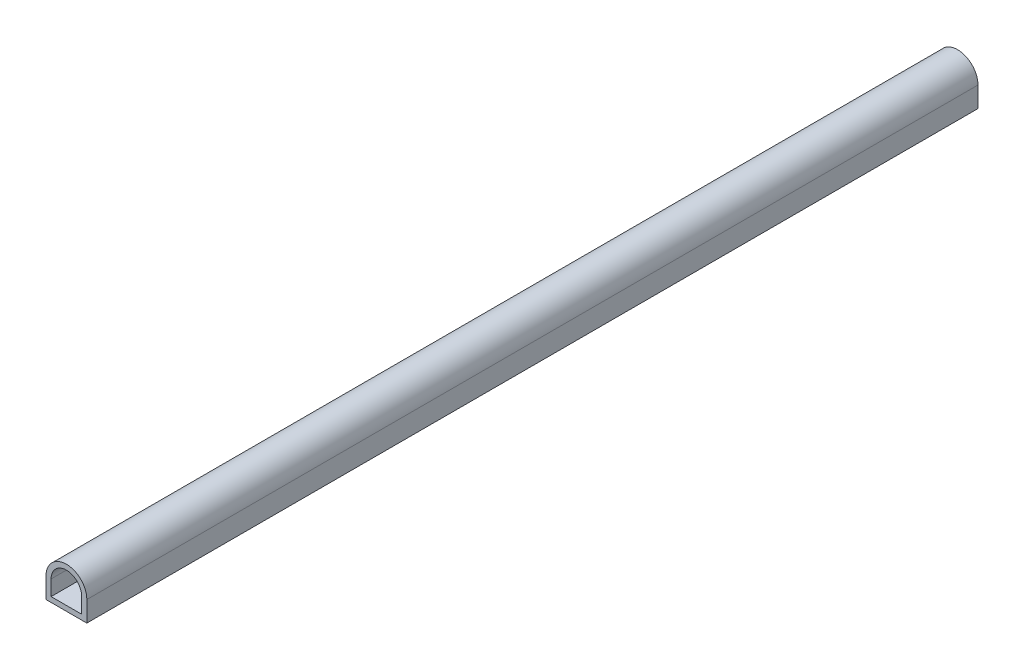
ISO-10303-21;
HEADER;
FILE_DESCRIPTION(('STEP AP214'),'2;1');
FILE_NAME('part.step','',(''),(''),'','','');
FILE_SCHEMA(('AUTOMOTIVE_DESIGN { 1 0 10303 214 1 1 1 1 }'));
ENDSEC;
DATA;
#1=APPLICATION_CONTEXT('core data for automotive mechanical design processes');
#2=APPLICATION_PROTOCOL_DEFINITION('international standard','automotive_design',2000,#1);
#3=PRODUCT_CONTEXT('',#1,'mechanical');
#4=PRODUCT('Part','Part','',(#3));
#5=PRODUCT_RELATED_PRODUCT_CATEGORY('part','',(#4));
#6=PRODUCT_DEFINITION_FORMATION('','',#4);
#7=PRODUCT_DEFINITION_CONTEXT('part definition',#1,'design');
#8=PRODUCT_DEFINITION('design','',#6,#7);
#9=PRODUCT_DEFINITION_SHAPE('','',#8);
#10=(LENGTH_UNIT() NAMED_UNIT(*) SI_UNIT(.MILLI.,.METRE.));
#11=(NAMED_UNIT(*) PLANE_ANGLE_UNIT() SI_UNIT($,.RADIAN.));
#12=(NAMED_UNIT(*) SI_UNIT($,.STERADIAN.) SOLID_ANGLE_UNIT());
#13=UNCERTAINTY_MEASURE_WITH_UNIT(LENGTH_MEASURE(1.E-05),#10,'distance_accuracy_value','');
#14=(GEOMETRIC_REPRESENTATION_CONTEXT(3) GLOBAL_UNCERTAINTY_ASSIGNED_CONTEXT((#13)) GLOBAL_UNIT_ASSIGNED_CONTEXT((#10,
#11,#12)) REPRESENTATION_CONTEXT('',''));
#15=CARTESIAN_POINT('',(0.,0.,0.));
#16=DIRECTION('',(0.,0.,1.));
#17=DIRECTION('',(1.,0.,0.));
#18=AXIS2_PLACEMENT_3D('',#15,#16,#17);
#19=CARTESIAN_POINT('',(0.,0.,131.));
#20=DIRECTION('',(0.,0.,1.));
#21=DIRECTION('',(1.,0.,0.));
#22=AXIS2_PLACEMENT_3D('',#19,#20,#21);
#23=PLANE('',#22);
#24=DIRECTION('',(0.,-1.,0.));
#25=VECTOR('',#24,1.);
#26=CARTESIAN_POINT('',(-3.,-3.,131.));
#27=LINE('',#26,#25);
#28=CARTESIAN_POINT('',(-3.,0.,131.));
#29=VERTEX_POINT('',#28);
#30=CARTESIAN_POINT('',(-3.,-3.,131.));
#31=VERTEX_POINT('',#30);
#32=EDGE_CURVE('E133',#29,#31,#27,.T.);
#33=ORIENTED_EDGE('',*,*,#32,.T.);
#34=DIRECTION('',(1.,0.,0.));
#35=VECTOR('',#34,1.);
#36=CARTESIAN_POINT('',(-3.,-3.,131.));
#37=LINE('',#36,#35);
#38=CARTESIAN_POINT('',(3.,-3.,131.));
#39=VERTEX_POINT('',#38);
#40=EDGE_CURVE('E136',#31,#39,#37,.T.);
#41=ORIENTED_EDGE('',*,*,#40,.T.);
#42=DIRECTION('',(0.,1.,0.));
#43=VECTOR('',#42,1.);
#44=CARTESIAN_POINT('',(3.,-3.,131.));
#45=LINE('',#44,#43);
#46=CARTESIAN_POINT('',(3.,0.,131.));
#47=VERTEX_POINT('',#46);
#48=EDGE_CURVE('E139',#39,#47,#45,.T.);
#49=ORIENTED_EDGE('',*,*,#48,.T.);
#50=CARTESIAN_POINT('',(0.,0.,131.));
#51=DIRECTION('',(0.,0.,1.));
#52=DIRECTION('',(1.,0.,0.));
#53=AXIS2_PLACEMENT_3D('',#50,#51,#52);
#54=CIRCLE('',#53,3.);
#55=EDGE_CURVE('E141',#47,#29,#54,.T.);
#56=ORIENTED_EDGE('',*,*,#55,.T.);
#57=EDGE_LOOP('',(#33,#41,#49,#56));
#58=FACE_BOUND('',#57,.T.);
#59=DIRECTION('',(1.,0.,0.));
#60=VECTOR('',#59,1.);
#61=CARTESIAN_POINT('',(-2.25,-2.25,131.));
#62=LINE('',#61,#60);
#63=CARTESIAN_POINT('',(-2.25,-2.25,131.));
#64=VERTEX_POINT('',#63);
#65=CARTESIAN_POINT('',(2.25,-2.25,131.));
#66=VERTEX_POINT('',#65);
#67=EDGE_CURVE('E105',#64,#66,#62,.T.);
#68=ORIENTED_EDGE('',*,*,#67,.F.);
#69=DIRECTION('',(0.,-1.,0.));
#70=VECTOR('',#69,1.);
#71=CARTESIAN_POINT('',(-2.25,-2.25,131.));
#72=LINE('',#71,#70);
#73=CARTESIAN_POINT('',(-2.25,0.,131.));
#74=VERTEX_POINT('',#73);
#75=EDGE_CURVE('E97',#74,#64,#72,.T.);
#76=ORIENTED_EDGE('',*,*,#75,.F.);
#77=CARTESIAN_POINT('',(0.,0.,131.));
#78=DIRECTION('',(0.,0.,1.));
#79=DIRECTION('',(1.,0.,0.));
#80=AXIS2_PLACEMENT_3D('',#77,#78,#79);
#81=CIRCLE('',#80,2.25);
#82=CARTESIAN_POINT('',(2.25,0.,131.));
#83=VERTEX_POINT('',#82);
#84=EDGE_CURVE('E119',#83,#74,#81,.T.);
#85=ORIENTED_EDGE('',*,*,#84,.F.);
#86=DIRECTION('',(0.,1.,0.));
#87=VECTOR('',#86,1.);
#88=CARTESIAN_POINT('',(2.25,-2.25,131.));
#89=LINE('',#88,#87);
#90=EDGE_CURVE('E117',#66,#83,#89,.T.);
#91=ORIENTED_EDGE('',*,*,#90,.F.);
#92=EDGE_LOOP('',(#68,#76,#85,#91));
#93=FACE_BOUND('',#92,.T.);
#94=ADVANCED_FACE('F32',(#58,#93),#23,.T.);
#95=CARTESIAN_POINT('',(0.,0.,0.));
#96=DIRECTION('',(0.,0.,1.));
#97=DIRECTION('',(1.,0.,0.));
#98=AXIS2_PLACEMENT_3D('',#95,#96,#97);
#99=PLANE('',#98);
#100=DIRECTION('',(0.,-1.,0.));
#101=VECTOR('',#100,1.);
#102=CARTESIAN_POINT('',(-3.,-3.,0.));
#103=LINE('',#102,#101);
#104=CARTESIAN_POINT('',(-3.,0.,0.));
#105=VERTEX_POINT('',#104);
#106=CARTESIAN_POINT('',(-3.,-3.,0.));
#107=VERTEX_POINT('',#106);
#108=EDGE_CURVE('E113',#105,#107,#103,.T.);
#109=ORIENTED_EDGE('',*,*,#108,.F.);
#110=CARTESIAN_POINT('',(0.,0.,0.));
#111=DIRECTION('',(0.,0.,1.));
#112=DIRECTION('',(1.,0.,0.));
#113=AXIS2_PLACEMENT_3D('',#110,#111,#112);
#114=CIRCLE('',#113,3.);
#115=CARTESIAN_POINT('',(3.,0.,0.));
#116=VERTEX_POINT('',#115);
#117=EDGE_CURVE('E137',#116,#105,#114,.T.);
#118=ORIENTED_EDGE('',*,*,#117,.F.);
#119=DIRECTION('',(0.,1.,0.));
#120=VECTOR('',#119,1.);
#121=CARTESIAN_POINT('',(3.,-3.,0.));
#122=LINE('',#121,#120);
#123=CARTESIAN_POINT('',(3.,-3.,0.));
#124=VERTEX_POINT('',#123);
#125=EDGE_CURVE('E148',#124,#116,#122,.T.);
#126=ORIENTED_EDGE('',*,*,#125,.F.);
#127=DIRECTION('',(1.,0.,0.));
#128=VECTOR('',#127,1.);
#129=CARTESIAN_POINT('',(-3.,-3.,0.));
#130=LINE('',#129,#128);
#131=EDGE_CURVE('E146',#107,#124,#130,.T.);
#132=ORIENTED_EDGE('',*,*,#131,.F.);
#133=EDGE_LOOP('',(#109,#118,#126,#132));
#134=FACE_BOUND('',#133,.T.);
#135=DIRECTION('',(0.,-1.,0.));
#136=VECTOR('',#135,1.);
#137=CARTESIAN_POINT('',(-2.25,-2.25,0.));
#138=LINE('',#137,#136);
#139=CARTESIAN_POINT('',(-2.25,0.,0.));
#140=VERTEX_POINT('',#139);
#141=CARTESIAN_POINT('',(-2.25,-2.25,0.));
#142=VERTEX_POINT('',#141);
#143=EDGE_CURVE('E55',#140,#142,#138,.T.);
#144=ORIENTED_EDGE('',*,*,#143,.T.);
#145=DIRECTION('',(1.,0.,0.));
#146=VECTOR('',#145,1.);
#147=CARTESIAN_POINT('',(-2.25,-2.25,0.));
#148=LINE('',#147,#146);
#149=CARTESIAN_POINT('',(2.25,-2.25,0.));
#150=VERTEX_POINT('',#149);
#151=EDGE_CURVE('E112',#142,#150,#148,.T.);
#152=ORIENTED_EDGE('',*,*,#151,.T.);
#153=DIRECTION('',(0.,1.,0.));
#154=VECTOR('',#153,1.);
#155=CARTESIAN_POINT('',(2.25,-2.25,0.));
#156=LINE('',#155,#154);
#157=CARTESIAN_POINT('',(2.25,0.,0.));
#158=VERTEX_POINT('',#157);
#159=EDGE_CURVE('E125',#150,#158,#156,.T.);
#160=ORIENTED_EDGE('',*,*,#159,.T.);
#161=CARTESIAN_POINT('',(0.,0.,0.));
#162=DIRECTION('',(0.,0.,1.));
#163=DIRECTION('',(1.,0.,0.));
#164=AXIS2_PLACEMENT_3D('',#161,#162,#163);
#165=CIRCLE('',#164,2.25);
#166=EDGE_CURVE('E106',#158,#140,#165,.T.);
#167=ORIENTED_EDGE('',*,*,#166,.T.);
#168=EDGE_LOOP('',(#144,#152,#160,#167));
#169=FACE_BOUND('',#168,.T.);
#170=ADVANCED_FACE('F166',(#134,#169),#99,.F.);
#171=CARTESIAN_POINT('',(-3.,-3.,131.));
#172=DIRECTION('',(1.,0.,0.));
#173=DIRECTION('',(0.,0.,-1.));
#174=AXIS2_PLACEMENT_3D('',#171,#172,#173);
#175=PLANE('',#174);
#176=ORIENTED_EDGE('',*,*,#108,.T.);
#177=DIRECTION('',(0.,0.,-1.));
#178=VECTOR('',#177,1.);
#179=CARTESIAN_POINT('',(-3.,-3.,131.));
#180=LINE('',#179,#178);
#181=EDGE_CURVE('E11',#31,#107,#180,.T.);
#182=ORIENTED_EDGE('',*,*,#181,.F.);
#183=ORIENTED_EDGE('',*,*,#32,.F.);
#184=DIRECTION('',(0.,0.,-1.));
#185=VECTOR('',#184,1.);
#186=CARTESIAN_POINT('',(-3.,0.,131.));
#187=LINE('',#186,#185);
#188=EDGE_CURVE('E143',#29,#105,#187,.T.);
#189=ORIENTED_EDGE('',*,*,#188,.T.);
#190=EDGE_LOOP('',(#176,#182,#183,#189));
#191=FACE_BOUND('',#190,.T.);
#192=ADVANCED_FACE('F34',(#191),#175,.F.);
#193=CARTESIAN_POINT('',(-3.,-3.,131.));
#194=DIRECTION('',(0.,1.,0.));
#195=DIRECTION('',(0.,0.,1.));
#196=AXIS2_PLACEMENT_3D('',#193,#194,#195);
#197=PLANE('',#196);
#198=ORIENTED_EDGE('',*,*,#131,.T.);
#199=DIRECTION('',(0.,0.,-1.));
#200=VECTOR('',#199,1.);
#201=CARTESIAN_POINT('',(3.,-3.,131.));
#202=LINE('',#201,#200);
#203=EDGE_CURVE('E40',#39,#124,#202,.T.);
#204=ORIENTED_EDGE('',*,*,#203,.F.);
#205=ORIENTED_EDGE('',*,*,#40,.F.);
#206=ORIENTED_EDGE('',*,*,#181,.T.);
#207=EDGE_LOOP('',(#198,#204,#205,#206));
#208=FACE_BOUND('',#207,.T.);
#209=ADVANCED_FACE('F176',(#208),#197,.F.);
#210=CARTESIAN_POINT('',(3.,-3.,131.));
#211=DIRECTION('',(-1.,0.,0.));
#212=DIRECTION('',(0.,0.,1.));
#213=AXIS2_PLACEMENT_3D('',#210,#211,#212);
#214=PLANE('',#213);
#215=ORIENTED_EDGE('',*,*,#125,.T.);
#216=DIRECTION('',(0.,0.,-1.));
#217=VECTOR('',#216,1.);
#218=CARTESIAN_POINT('',(3.,0.,131.));
#219=LINE('',#218,#217);
#220=EDGE_CURVE('E153',#47,#116,#219,.T.);
#221=ORIENTED_EDGE('',*,*,#220,.F.);
#222=ORIENTED_EDGE('',*,*,#48,.F.);
#223=ORIENTED_EDGE('',*,*,#203,.T.);
#224=EDGE_LOOP('',(#215,#221,#222,#223));
#225=FACE_BOUND('',#224,.T.);
#226=ADVANCED_FACE('F160',(#225),#214,.F.);
#227=CARTESIAN_POINT('',(0.,0.,131.));
#228=DIRECTION('',(0.,0.,-1.));
#229=DIRECTION('',(-1.,0.,0.));
#230=AXIS2_PLACEMENT_3D('',#227,#228,#229);
#231=CYLINDRICAL_SURFACE('',#230,3.);
#232=ORIENTED_EDGE('',*,*,#117,.T.);
#233=ORIENTED_EDGE('',*,*,#188,.F.);
#234=ORIENTED_EDGE('',*,*,#55,.F.);
#235=ORIENTED_EDGE('',*,*,#220,.T.);
#236=EDGE_LOOP('',(#232,#233,#234,#235));
#237=FACE_BOUND('',#236,.T.);
#238=ADVANCED_FACE('F170',(#237),#231,.T.);
#239=CARTESIAN_POINT('',(-2.25,-2.25,131.));
#240=DIRECTION('',(1.,0.,0.));
#241=DIRECTION('',(0.,0.,-1.));
#242=AXIS2_PLACEMENT_3D('',#239,#240,#241);
#243=PLANE('',#242);
#244=ORIENTED_EDGE('',*,*,#143,.F.);
#245=DIRECTION('',(0.,0.,-1.));
#246=VECTOR('',#245,1.);
#247=CARTESIAN_POINT('',(-2.25,0.,131.));
#248=LINE('',#247,#246);
#249=EDGE_CURVE('E101',#74,#140,#248,.T.);
#250=ORIENTED_EDGE('',*,*,#249,.F.);
#251=ORIENTED_EDGE('',*,*,#75,.T.);
#252=DIRECTION('',(0.,0.,-1.));
#253=VECTOR('',#252,1.);
#254=CARTESIAN_POINT('',(-2.25,-2.25,131.));
#255=LINE('',#254,#253);
#256=EDGE_CURVE('E100',#64,#142,#255,.T.);
#257=ORIENTED_EDGE('',*,*,#256,.T.);
#258=EDGE_LOOP('',(#244,#250,#251,#257));
#259=FACE_BOUND('',#258,.T.);
#260=ADVANCED_FACE('F99',(#259),#243,.T.);
#261=CARTESIAN_POINT('',(-2.25,-2.25,131.));
#262=DIRECTION('',(0.,1.,0.));
#263=DIRECTION('',(0.,0.,1.));
#264=AXIS2_PLACEMENT_3D('',#261,#262,#263);
#265=PLANE('',#264);
#266=ORIENTED_EDGE('',*,*,#151,.F.);
#267=ORIENTED_EDGE('',*,*,#256,.F.);
#268=ORIENTED_EDGE('',*,*,#67,.T.);
#269=DIRECTION('',(0.,0.,-1.));
#270=VECTOR('',#269,1.);
#271=CARTESIAN_POINT('',(2.25,-2.25,131.));
#272=LINE('',#271,#270);
#273=EDGE_CURVE('E114',#66,#150,#272,.T.);
#274=ORIENTED_EDGE('',*,*,#273,.T.);
#275=EDGE_LOOP('',(#266,#267,#268,#274));
#276=FACE_BOUND('',#275,.T.);
#277=ADVANCED_FACE('F109',(#276),#265,.T.);
#278=CARTESIAN_POINT('',(2.25,-2.25,131.));
#279=DIRECTION('',(-1.,0.,0.));
#280=DIRECTION('',(0.,0.,1.));
#281=AXIS2_PLACEMENT_3D('',#278,#279,#280);
#282=PLANE('',#281);
#283=ORIENTED_EDGE('',*,*,#159,.F.);
#284=ORIENTED_EDGE('',*,*,#273,.F.);
#285=ORIENTED_EDGE('',*,*,#90,.T.);
#286=DIRECTION('',(0.,0.,-1.));
#287=VECTOR('',#286,1.);
#288=CARTESIAN_POINT('',(2.25,0.,131.));
#289=LINE('',#288,#287);
#290=EDGE_CURVE('E47',#83,#158,#289,.T.);
#291=ORIENTED_EDGE('',*,*,#290,.T.);
#292=EDGE_LOOP('',(#283,#284,#285,#291));
#293=FACE_BOUND('',#292,.T.);
#294=ADVANCED_FACE('F199',(#293),#282,.T.);
#295=CARTESIAN_POINT('',(0.,0.,131.));
#296=DIRECTION('',(0.,0.,-1.));
#297=DIRECTION('',(-1.,0.,0.));
#298=AXIS2_PLACEMENT_3D('',#295,#296,#297);
#299=CYLINDRICAL_SURFACE('',#298,2.25);
#300=ORIENTED_EDGE('',*,*,#166,.F.);
#301=ORIENTED_EDGE('',*,*,#290,.F.);
#302=ORIENTED_EDGE('',*,*,#84,.T.);
#303=ORIENTED_EDGE('',*,*,#249,.T.);
#304=EDGE_LOOP('',(#300,#301,#302,#303));
#305=FACE_BOUND('',#304,.T.);
#306=ADVANCED_FACE('F203',(#305),#299,.F.);
#307=CLOSED_SHELL('',(#94,#170,#192,#209,#226,#238,#260,#277,#294,#306));
#308=MANIFOLD_SOLID_BREP('B2',#307);
#309=ADVANCED_BREP_SHAPE_REPRESENTATION('',(#18,#308),#14);
#310=SHAPE_DEFINITION_REPRESENTATION(#9,#309);
ENDSEC;
END-ISO-10303-21;
